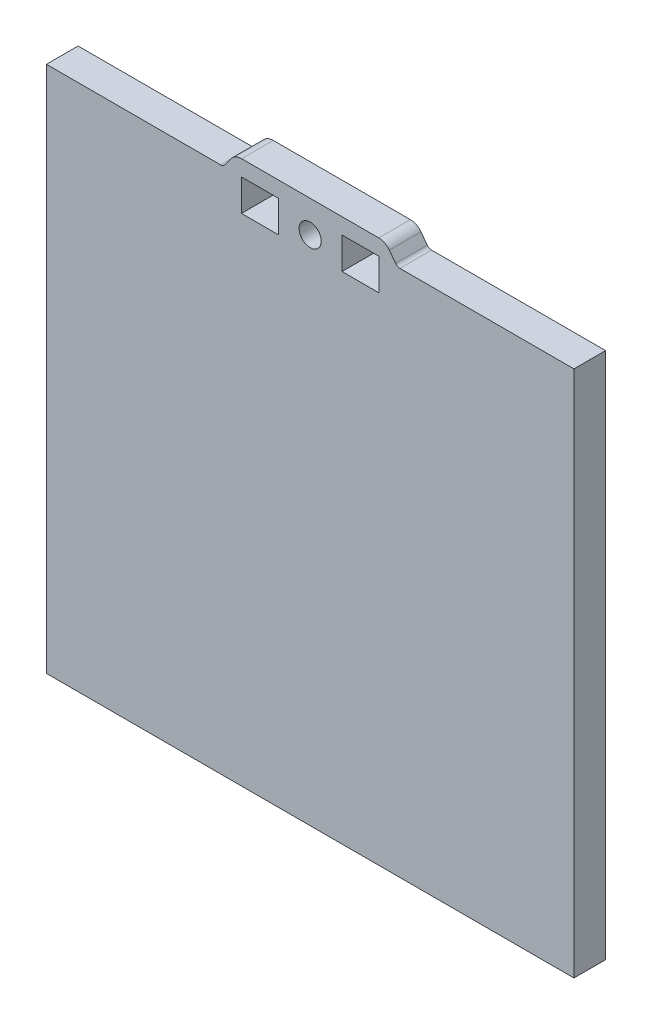
ISO-10303-21;
HEADER;
FILE_DESCRIPTION(('STEP AP214'),'2;1');
FILE_NAME('part.step','',(''),(''),'','','');
FILE_SCHEMA(('AUTOMOTIVE_DESIGN { 1 0 10303 214 1 1 1 1 }'));
ENDSEC;
DATA;
#1=APPLICATION_CONTEXT('core data for automotive mechanical design processes');
#2=APPLICATION_PROTOCOL_DEFINITION('international standard','automotive_design',2000,#1);
#3=PRODUCT_CONTEXT('',#1,'mechanical');
#4=PRODUCT('Part','Part','',(#3));
#5=PRODUCT_RELATED_PRODUCT_CATEGORY('part','',(#4));
#6=PRODUCT_DEFINITION_FORMATION('','',#4);
#7=PRODUCT_DEFINITION_CONTEXT('part definition',#1,'design');
#8=PRODUCT_DEFINITION('design','',#6,#7);
#9=PRODUCT_DEFINITION_SHAPE('','',#8);
#10=(LENGTH_UNIT() NAMED_UNIT(*) SI_UNIT(.MILLI.,.METRE.));
#11=(NAMED_UNIT(*) PLANE_ANGLE_UNIT() SI_UNIT($,.RADIAN.));
#12=(NAMED_UNIT(*) SI_UNIT($,.STERADIAN.) SOLID_ANGLE_UNIT());
#13=UNCERTAINTY_MEASURE_WITH_UNIT(LENGTH_MEASURE(1.E-05),#10,'distance_accuracy_value','');
#14=(GEOMETRIC_REPRESENTATION_CONTEXT(3) GLOBAL_UNCERTAINTY_ASSIGNED_CONTEXT((#13)) GLOBAL_UNIT_ASSIGNED_CONTEXT((#10,
#11,#12)) REPRESENTATION_CONTEXT('',''));
#15=CARTESIAN_POINT('',(0.,0.,0.));
#16=DIRECTION('',(0.,0.,1.));
#17=DIRECTION('',(1.,0.,0.));
#18=AXIS2_PLACEMENT_3D('',#15,#16,#17);
#19=CARTESIAN_POINT('',(-50.,50.,6.));
#20=DIRECTION('',(0.,-1.,0.));
#21=DIRECTION('',(0.,0.,-1.));
#22=AXIS2_PLACEMENT_3D('',#19,#20,#21);
#23=PLANE('',#22);
#24=DIRECTION('',(-1.,0.,0.));
#25=VECTOR('',#24,1.);
#26=CARTESIAN_POINT('',(-50.,50.,6.));
#27=LINE('',#26,#25);
#28=CARTESIAN_POINT('',(-17.,50.,6.));
#29=VERTEX_POINT('',#28);
#30=CARTESIAN_POINT('',(-50.,50.,6.));
#31=VERTEX_POINT('',#30);
#32=EDGE_CURVE('E313',#29,#31,#27,.T.);
#33=ORIENTED_EDGE('',*,*,#32,.F.);
#34=DIRECTION('',(0.,0.,-1.));
#35=VECTOR('',#34,1.);
#36=CARTESIAN_POINT('',(-17.,50.,6.));
#37=LINE('',#36,#35);
#38=CARTESIAN_POINT('',(-17.,50.,0.));
#39=VERTEX_POINT('',#38);
#40=EDGE_CURVE('E303',#29,#39,#37,.T.);
#41=ORIENTED_EDGE('',*,*,#40,.T.);
#42=DIRECTION('',(-1.,0.,0.));
#43=VECTOR('',#42,1.);
#44=CARTESIAN_POINT('',(-50.,50.,0.));
#45=LINE('',#44,#43);
#46=CARTESIAN_POINT('',(-50.,50.,0.));
#47=VERTEX_POINT('',#46);
#48=EDGE_CURVE('E325',#39,#47,#45,.T.);
#49=ORIENTED_EDGE('',*,*,#48,.T.);
#50=DIRECTION('',(0.,0.,-1.));
#51=VECTOR('',#50,1.);
#52=CARTESIAN_POINT('',(-50.,50.,6.));
#53=LINE('',#52,#51);
#54=EDGE_CURVE('E45',#31,#47,#53,.T.);
#55=ORIENTED_EDGE('',*,*,#54,.F.);
#56=EDGE_LOOP('',(#33,#41,#49,#55));
#57=FACE_BOUND('',#56,.T.);
#58=ADVANCED_FACE('F37',(#57),#23,.F.);
#59=CARTESIAN_POINT('',(50.,-50.,6.));
#60=DIRECTION('',(-1.,0.,0.));
#61=DIRECTION('',(0.,0.,1.));
#62=AXIS2_PLACEMENT_3D('',#59,#60,#61);
#63=PLANE('',#62);
#64=DIRECTION('',(0.,1.,0.));
#65=VECTOR('',#64,1.);
#66=CARTESIAN_POINT('',(50.,-50.,0.));
#67=LINE('',#66,#65);
#68=CARTESIAN_POINT('',(50.,-50.,0.));
#69=VERTEX_POINT('',#68);
#70=CARTESIAN_POINT('',(50.,50.,0.));
#71=VERTEX_POINT('',#70);
#72=EDGE_CURVE('E309',#69,#71,#67,.T.);
#73=ORIENTED_EDGE('',*,*,#72,.T.);
#74=DIRECTION('',(0.,0.,-1.));
#75=VECTOR('',#74,1.);
#76=CARTESIAN_POINT('',(50.,50.,6.));
#77=LINE('',#76,#75);
#78=CARTESIAN_POINT('',(50.,50.,6.));
#79=VERTEX_POINT('',#78);
#80=EDGE_CURVE('E11',#79,#71,#77,.T.);
#81=ORIENTED_EDGE('',*,*,#80,.F.);
#82=DIRECTION('',(0.,1.,0.));
#83=VECTOR('',#82,1.);
#84=CARTESIAN_POINT('',(50.,-50.,6.));
#85=LINE('',#84,#83);
#86=CARTESIAN_POINT('',(50.,-50.,6.));
#87=VERTEX_POINT('',#86);
#88=EDGE_CURVE('E310',#87,#79,#85,.T.);
#89=ORIENTED_EDGE('',*,*,#88,.F.);
#90=DIRECTION('',(0.,0.,-1.));
#91=VECTOR('',#90,1.);
#92=CARTESIAN_POINT('',(50.,-50.,6.));
#93=LINE('',#92,#91);
#94=EDGE_CURVE('E322',#87,#69,#93,.T.);
#95=ORIENTED_EDGE('',*,*,#94,.T.);
#96=EDGE_LOOP('',(#73,#81,#89,#95));
#97=FACE_BOUND('',#96,.T.);
#98=ADVANCED_FACE('F39',(#97),#63,.F.);
#99=CARTESIAN_POINT('',(17.,50.,0.));
#100=VERTEX_POINT('',#99);
#101=EDGE_CURVE('E326',#71,#100,#45,.T.);
#102=ORIENTED_EDGE('',*,*,#101,.T.);
#103=DIRECTION('',(0.,0.,-1.));
#104=VECTOR('',#103,1.);
#105=CARTESIAN_POINT('',(17.,50.,6.));
#106=LINE('',#105,#104);
#107=CARTESIAN_POINT('',(17.,50.,6.));
#108=VERTEX_POINT('',#107);
#109=EDGE_CURVE('E300',#108,#100,#106,.T.);
#110=ORIENTED_EDGE('',*,*,#109,.F.);
#111=EDGE_CURVE('E315',#79,#108,#27,.T.);
#112=ORIENTED_EDGE('',*,*,#111,.F.);
#113=ORIENTED_EDGE('',*,*,#80,.T.);
#114=EDGE_LOOP('',(#102,#110,#112,#113));
#115=FACE_BOUND('',#114,.T.);
#116=ADVANCED_FACE('F385',(#115),#23,.F.);
#117=CARTESIAN_POINT('',(-50.,-50.,6.));
#118=DIRECTION('',(1.,0.,0.));
#119=DIRECTION('',(0.,0.,-1.));
#120=AXIS2_PLACEMENT_3D('',#117,#118,#119);
#121=PLANE('',#120);
#122=DIRECTION('',(0.,-1.,0.));
#123=VECTOR('',#122,1.);
#124=CARTESIAN_POINT('',(-50.,-50.,0.));
#125=LINE('',#124,#123);
#126=CARTESIAN_POINT('',(-50.,-50.,0.));
#127=VERTEX_POINT('',#126);
#128=EDGE_CURVE('E328',#47,#127,#125,.T.);
#129=ORIENTED_EDGE('',*,*,#128,.T.);
#130=DIRECTION('',(0.,0.,-1.));
#131=VECTOR('',#130,1.);
#132=CARTESIAN_POINT('',(-50.,-50.,6.));
#133=LINE('',#132,#131);
#134=CARTESIAN_POINT('',(-50.,-50.,6.));
#135=VERTEX_POINT('',#134);
#136=EDGE_CURVE('E333',#135,#127,#133,.T.);
#137=ORIENTED_EDGE('',*,*,#136,.F.);
#138=DIRECTION('',(0.,-1.,0.));
#139=VECTOR('',#138,1.);
#140=CARTESIAN_POINT('',(-50.,-50.,6.));
#141=LINE('',#140,#139);
#142=EDGE_CURVE('E318',#31,#135,#141,.T.);
#143=ORIENTED_EDGE('',*,*,#142,.F.);
#144=ORIENTED_EDGE('',*,*,#54,.T.);
#145=EDGE_LOOP('',(#129,#137,#143,#144));
#146=FACE_BOUND('',#145,.T.);
#147=ADVANCED_FACE('F340',(#146),#121,.F.);
#148=CARTESIAN_POINT('',(-50.,-50.,6.));
#149=DIRECTION('',(0.,1.,0.));
#150=DIRECTION('',(0.,0.,1.));
#151=AXIS2_PLACEMENT_3D('',#148,#149,#150);
#152=PLANE('',#151);
#153=DIRECTION('',(1.,0.,0.));
#154=VECTOR('',#153,1.);
#155=CARTESIAN_POINT('',(-50.,-50.,0.));
#156=LINE('',#155,#154);
#157=EDGE_CURVE('E314',#127,#69,#156,.T.);
#158=ORIENTED_EDGE('',*,*,#157,.T.);
#159=ORIENTED_EDGE('',*,*,#94,.F.);
#160=DIRECTION('',(1.,0.,0.));
#161=VECTOR('',#160,1.);
#162=CARTESIAN_POINT('',(-50.,-50.,6.));
#163=LINE('',#162,#161);
#164=EDGE_CURVE('E320',#135,#87,#163,.T.);
#165=ORIENTED_EDGE('',*,*,#164,.F.);
#166=ORIENTED_EDGE('',*,*,#136,.T.);
#167=EDGE_LOOP('',(#158,#159,#165,#166));
#168=FACE_BOUND('',#167,.T.);
#169=ADVANCED_FACE('F348',(#168),#152,.F.);
#170=CARTESIAN_POINT('',(0.,0.,6.));
#171=DIRECTION('',(0.,0.,-1.));
#172=DIRECTION('',(-1.,0.,0.));
#173=AXIS2_PLACEMENT_3D('',#170,#171,#172);
#174=PLANE('',#173);
#175=DIRECTION('',(-1.,0.,0.));
#176=VECTOR('',#175,1.);
#177=CARTESIAN_POINT('',(13.0318499082157,50.,6.));
#178=LINE('',#177,#176);
#179=CARTESIAN_POINT('',(13.0318499082157,50.,6.));
#180=VERTEX_POINT('',#179);
#181=CARTESIAN_POINT('',(6.03184990821572,50.,6.));
#182=VERTEX_POINT('',#181);
#183=EDGE_CURVE('E204',#180,#182,#178,.T.);
#184=ORIENTED_EDGE('',*,*,#183,.F.);
#185=DIRECTION('',(0.,1.,0.));
#186=VECTOR('',#185,1.);
#187=CARTESIAN_POINT('',(13.0318499082157,50.,6.));
#188=LINE('',#187,#186);
#189=CARTESIAN_POINT('',(13.0318499082157,44.,6.));
#190=VERTEX_POINT('',#189);
#191=EDGE_CURVE('E52',#190,#180,#188,.T.);
#192=ORIENTED_EDGE('',*,*,#191,.F.);
#193=DIRECTION('',(1.,0.,0.));
#194=VECTOR('',#193,1.);
#195=CARTESIAN_POINT('',(13.0318499082157,44.,6.));
#196=LINE('',#195,#194);
#197=CARTESIAN_POINT('',(6.03184990821572,44.,6.));
#198=VERTEX_POINT('',#197);
#199=EDGE_CURVE('E195',#198,#190,#196,.T.);
#200=ORIENTED_EDGE('',*,*,#199,.F.);
#201=DIRECTION('',(0.,-1.,0.));
#202=VECTOR('',#201,1.);
#203=CARTESIAN_POINT('',(6.03184990821572,50.,6.));
#204=LINE('',#203,#202);
#205=EDGE_CURVE('E198',#182,#198,#204,.T.);
#206=ORIENTED_EDGE('',*,*,#205,.F.);
#207=EDGE_LOOP('',(#184,#192,#200,#206));
#208=FACE_BOUND('',#207,.T.);
#209=DIRECTION('',(1.,0.,0.));
#210=VECTOR('',#209,1.);
#211=CARTESIAN_POINT('',(-13.0318499082157,44.,6.));
#212=LINE('',#211,#210);
#213=CARTESIAN_POINT('',(-13.0318499082157,44.,6.));
#214=VERTEX_POINT('',#213);
#215=CARTESIAN_POINT('',(-6.03184990821574,44.,6.));
#216=VERTEX_POINT('',#215);
#217=EDGE_CURVE('E230',#214,#216,#212,.T.);
#218=ORIENTED_EDGE('',*,*,#217,.F.);
#219=DIRECTION('',(0.,-1.,0.));
#220=VECTOR('',#219,1.);
#221=CARTESIAN_POINT('',(-13.0318499082157,50.,6.));
#222=LINE('',#221,#220);
#223=CARTESIAN_POINT('',(-13.0318499082157,50.,6.));
#224=VERTEX_POINT('',#223);
#225=EDGE_CURVE('E60',#224,#214,#222,.T.);
#226=ORIENTED_EDGE('',*,*,#225,.F.);
#227=DIRECTION('',(-1.,0.,0.));
#228=VECTOR('',#227,1.);
#229=CARTESIAN_POINT('',(-13.0318499082157,50.,6.));
#230=LINE('',#229,#228);
#231=CARTESIAN_POINT('',(-6.03184990821574,50.,6.));
#232=VERTEX_POINT('',#231);
#233=EDGE_CURVE('E219',#232,#224,#230,.T.);
#234=ORIENTED_EDGE('',*,*,#233,.F.);
#235=DIRECTION('',(0.,1.,0.));
#236=VECTOR('',#235,1.);
#237=CARTESIAN_POINT('',(-6.03184990821574,50.,6.));
#238=LINE('',#237,#236);
#239=EDGE_CURVE('E234',#216,#232,#238,.T.);
#240=ORIENTED_EDGE('',*,*,#239,.F.);
#241=EDGE_LOOP('',(#218,#226,#234,#240));
#242=FACE_BOUND('',#241,.T.);
#243=CARTESIAN_POINT('',(0.,47.0000000000004,6.));
#244=DIRECTION('',(0.,0.,1.));
#245=DIRECTION('',(1.,0.,0.));
#246=AXIS2_PLACEMENT_3D('',#243,#244,#245);
#247=CIRCLE('',#246,2.1);
#248=CARTESIAN_POINT('',(2.1,47.0000000000004,6.));
#249=VERTEX_POINT('',#248);
#250=EDGE_CURVE('E247',#249,#249,#247,.T.);
#251=ORIENTED_EDGE('',*,*,#250,.F.);
#252=EDGE_LOOP('',(#251));
#253=FACE_BOUND('',#252,.T.);
#254=ORIENTED_EDGE('',*,*,#88,.T.);
#255=ORIENTED_EDGE('',*,*,#111,.T.);
#256=CARTESIAN_POINT('',(17.,51.,6.));
#257=DIRECTION('',(0.,0.,1.));
#258=DIRECTION('',(1.,0.,0.));
#259=AXIS2_PLACEMENT_3D('',#256,#257,#258);
#260=CIRCLE('',#259,0.999999999999997);
#261=CARTESIAN_POINT('',(16.2,50.4,6.));
#262=VERTEX_POINT('',#261);
#263=EDGE_CURVE('E257',#262,#108,#260,.T.);
#264=ORIENTED_EDGE('',*,*,#263,.F.);
#265=DIRECTION('',(0.6,-0.8,0.));
#266=VECTOR('',#265,1.);
#267=CARTESIAN_POINT('',(34.56,25.92,6.));
#268=LINE('',#267,#266);
#269=CARTESIAN_POINT('',(15.,52.,6.));
#270=VERTEX_POINT('',#269);
#271=EDGE_CURVE('E260',#270,#262,#268,.T.);
#272=ORIENTED_EDGE('',*,*,#271,.F.);
#273=CARTESIAN_POINT('',(13.,50.5,6.));
#274=DIRECTION('',(0.,0.,1.));
#275=DIRECTION('',(1.,0.,0.));
#276=AXIS2_PLACEMENT_3D('',#273,#274,#275);
#277=CIRCLE('',#276,2.49999999999999);
#278=CARTESIAN_POINT('',(13.,53.,6.));
#279=VERTEX_POINT('',#278);
#280=EDGE_CURVE('E263',#279,#270,#277,.F.);
#281=ORIENTED_EDGE('',*,*,#280,.F.);
#282=DIRECTION('',(1.,0.,0.));
#283=VECTOR('',#282,1.);
#284=CARTESIAN_POINT('',(0.,53.,6.));
#285=LINE('',#284,#283);
#286=CARTESIAN_POINT('',(-13.,53.,6.));
#287=VERTEX_POINT('',#286);
#288=EDGE_CURVE('E266',#287,#279,#285,.T.);
#289=ORIENTED_EDGE('',*,*,#288,.F.);
#290=CARTESIAN_POINT('',(-13.,50.5,6.));
#291=DIRECTION('',(0.,0.,1.));
#292=DIRECTION('',(1.,0.,0.));
#293=AXIS2_PLACEMENT_3D('',#290,#291,#292);
#294=CIRCLE('',#293,2.49999999999999);
#295=CARTESIAN_POINT('',(-15.,52.,6.));
#296=VERTEX_POINT('',#295);
#297=EDGE_CURVE('E269',#287,#296,#294,.T.);
#298=ORIENTED_EDGE('',*,*,#297,.T.);
#299=DIRECTION('',(-0.6,-0.8,0.));
#300=VECTOR('',#299,1.);
#301=CARTESIAN_POINT('',(-34.56,25.92,6.));
#302=LINE('',#301,#300);
#303=CARTESIAN_POINT('',(-16.2,50.4,6.));
#304=VERTEX_POINT('',#303);
#305=EDGE_CURVE('E250',#296,#304,#302,.T.);
#306=ORIENTED_EDGE('',*,*,#305,.T.);
#307=CARTESIAN_POINT('',(-17.,51.,6.));
#308=DIRECTION('',(0.,0.,1.));
#309=DIRECTION('',(1.,0.,0.));
#310=AXIS2_PLACEMENT_3D('',#307,#308,#309);
#311=CIRCLE('',#310,0.999999999999997);
#312=EDGE_CURVE('E253',#304,#29,#311,.F.);
#313=ORIENTED_EDGE('',*,*,#312,.T.);
#314=ORIENTED_EDGE('',*,*,#32,.T.);
#315=ORIENTED_EDGE('',*,*,#142,.T.);
#316=ORIENTED_EDGE('',*,*,#164,.T.);
#317=EDGE_LOOP('',(#254,#255,#264,#272,#281,#289,#298,#306,#313,#314,#315,#316));
#318=FACE_BOUND('',#317,.T.);
#319=ADVANCED_FACE('F354',(#208,#242,#253,#318),#174,.F.);
#320=CARTESIAN_POINT('',(0.,0.,0.));
#321=DIRECTION('',(0.,0.,-1.));
#322=DIRECTION('',(-1.,0.,0.));
#323=AXIS2_PLACEMENT_3D('',#320,#321,#322);
#324=PLANE('',#323);
#325=DIRECTION('',(0.,1.,0.));
#326=VECTOR('',#325,1.);
#327=CARTESIAN_POINT('',(13.0318499082157,50.,0.));
#328=LINE('',#327,#326);
#329=CARTESIAN_POINT('',(13.0318499082157,44.,0.));
#330=VERTEX_POINT('',#329);
#331=CARTESIAN_POINT('',(13.0318499082157,50.,0.));
#332=VERTEX_POINT('',#331);
#333=EDGE_CURVE('E176',#330,#332,#328,.T.);
#334=ORIENTED_EDGE('',*,*,#333,.T.);
#335=DIRECTION('',(-1.,0.,0.));
#336=VECTOR('',#335,1.);
#337=CARTESIAN_POINT('',(13.0318499082157,50.,0.));
#338=LINE('',#337,#336);
#339=CARTESIAN_POINT('',(6.03184990821572,50.,0.));
#340=VERTEX_POINT('',#339);
#341=EDGE_CURVE('E186',#332,#340,#338,.T.);
#342=ORIENTED_EDGE('',*,*,#341,.T.);
#343=DIRECTION('',(0.,-1.,0.));
#344=VECTOR('',#343,1.);
#345=CARTESIAN_POINT('',(6.03184990821572,50.,0.));
#346=LINE('',#345,#344);
#347=CARTESIAN_POINT('',(6.03184990821572,44.,0.));
#348=VERTEX_POINT('',#347);
#349=EDGE_CURVE('E190',#340,#348,#346,.T.);
#350=ORIENTED_EDGE('',*,*,#349,.T.);
#351=DIRECTION('',(1.,0.,0.));
#352=VECTOR('',#351,1.);
#353=CARTESIAN_POINT('',(13.0318499082157,44.,0.));
#354=LINE('',#353,#352);
#355=EDGE_CURVE('E182',#348,#330,#354,.T.);
#356=ORIENTED_EDGE('',*,*,#355,.T.);
#357=EDGE_LOOP('',(#334,#342,#350,#356));
#358=FACE_BOUND('',#357,.T.);
#359=DIRECTION('',(0.,-1.,0.));
#360=VECTOR('',#359,1.);
#361=CARTESIAN_POINT('',(-13.0318499082157,50.,0.));
#362=LINE('',#361,#360);
#363=CARTESIAN_POINT('',(-13.0318499082157,50.,0.));
#364=VERTEX_POINT('',#363);
#365=CARTESIAN_POINT('',(-13.0318499082157,44.,0.));
#366=VERTEX_POINT('',#365);
#367=EDGE_CURVE('E215',#364,#366,#362,.T.);
#368=ORIENTED_EDGE('',*,*,#367,.T.);
#369=DIRECTION('',(1.,0.,0.));
#370=VECTOR('',#369,1.);
#371=CARTESIAN_POINT('',(-13.0318499082157,44.,0.));
#372=LINE('',#371,#370);
#373=CARTESIAN_POINT('',(-6.03184990821574,44.,0.));
#374=VERTEX_POINT('',#373);
#375=EDGE_CURVE('E218',#366,#374,#372,.T.);
#376=ORIENTED_EDGE('',*,*,#375,.T.);
#377=DIRECTION('',(0.,1.,0.));
#378=VECTOR('',#377,1.);
#379=CARTESIAN_POINT('',(-6.03184990821574,50.,0.));
#380=LINE('',#379,#378);
#381=CARTESIAN_POINT('',(-6.03184990821574,50.,0.));
#382=VERTEX_POINT('',#381);
#383=EDGE_CURVE('E222',#374,#382,#380,.T.);
#384=ORIENTED_EDGE('',*,*,#383,.T.);
#385=DIRECTION('',(-1.,0.,0.));
#386=VECTOR('',#385,1.);
#387=CARTESIAN_POINT('',(-13.0318499082157,50.,0.));
#388=LINE('',#387,#386);
#389=EDGE_CURVE('E225',#382,#364,#388,.T.);
#390=ORIENTED_EDGE('',*,*,#389,.T.);
#391=EDGE_LOOP('',(#368,#376,#384,#390));
#392=FACE_BOUND('',#391,.T.);
#393=CARTESIAN_POINT('',(0.,47.0000000000004,0.));
#394=DIRECTION('',(0.,0.,1.));
#395=DIRECTION('',(1.,0.,0.));
#396=AXIS2_PLACEMENT_3D('',#393,#394,#395);
#397=CIRCLE('',#396,2.1);
#398=CARTESIAN_POINT('',(2.1,47.0000000000004,0.));
#399=VERTEX_POINT('',#398);
#400=EDGE_CURVE('E231',#399,#399,#397,.T.);
#401=ORIENTED_EDGE('',*,*,#400,.T.);
#402=EDGE_LOOP('',(#401));
#403=FACE_BOUND('',#402,.T.);
#404=ORIENTED_EDGE('',*,*,#72,.F.);
#405=ORIENTED_EDGE('',*,*,#157,.F.);
#406=ORIENTED_EDGE('',*,*,#128,.F.);
#407=ORIENTED_EDGE('',*,*,#48,.F.);
#408=CARTESIAN_POINT('',(-17.,51.,0.));
#409=DIRECTION('',(0.,0.,1.));
#410=DIRECTION('',(1.,0.,0.));
#411=AXIS2_PLACEMENT_3D('',#408,#409,#410);
#412=CIRCLE('',#411,0.999999999999997);
#413=CARTESIAN_POINT('',(-16.2,50.4,0.));
#414=VERTEX_POINT('',#413);
#415=EDGE_CURVE('E274',#414,#39,#412,.F.);
#416=ORIENTED_EDGE('',*,*,#415,.F.);
#417=DIRECTION('',(-0.6,-0.8,0.));
#418=VECTOR('',#417,1.);
#419=CARTESIAN_POINT('',(-34.56,25.92,0.));
#420=LINE('',#419,#418);
#421=CARTESIAN_POINT('',(-15.,52.,0.));
#422=VERTEX_POINT('',#421);
#423=EDGE_CURVE('E211',#422,#414,#420,.T.);
#424=ORIENTED_EDGE('',*,*,#423,.F.);
#425=CARTESIAN_POINT('',(-13.,50.5,0.));
#426=DIRECTION('',(0.,0.,1.));
#427=DIRECTION('',(1.,0.,0.));
#428=AXIS2_PLACEMENT_3D('',#425,#426,#427);
#429=CIRCLE('',#428,2.49999999999999);
#430=CARTESIAN_POINT('',(-13.,53.,0.));
#431=VERTEX_POINT('',#430);
#432=EDGE_CURVE('E254',#431,#422,#429,.T.);
#433=ORIENTED_EDGE('',*,*,#432,.F.);
#434=DIRECTION('',(1.,0.,0.));
#435=VECTOR('',#434,1.);
#436=CARTESIAN_POINT('',(0.,53.,0.));
#437=LINE('',#436,#435);
#438=CARTESIAN_POINT('',(13.,53.,0.));
#439=VERTEX_POINT('',#438);
#440=EDGE_CURVE('E286',#431,#439,#437,.T.);
#441=ORIENTED_EDGE('',*,*,#440,.T.);
#442=CARTESIAN_POINT('',(13.,50.5,0.));
#443=DIRECTION('',(0.,0.,1.));
#444=DIRECTION('',(1.,0.,0.));
#445=AXIS2_PLACEMENT_3D('',#442,#443,#444);
#446=CIRCLE('',#445,2.49999999999999);
#447=CARTESIAN_POINT('',(15.,52.,0.));
#448=VERTEX_POINT('',#447);
#449=EDGE_CURVE('E283',#439,#448,#446,.F.);
#450=ORIENTED_EDGE('',*,*,#449,.T.);
#451=DIRECTION('',(0.6,-0.8,0.));
#452=VECTOR('',#451,1.);
#453=CARTESIAN_POINT('',(34.56,25.92,0.));
#454=LINE('',#453,#452);
#455=CARTESIAN_POINT('',(16.2,50.4,0.));
#456=VERTEX_POINT('',#455);
#457=EDGE_CURVE('E280',#448,#456,#454,.T.);
#458=ORIENTED_EDGE('',*,*,#457,.T.);
#459=CARTESIAN_POINT('',(17.,51.,0.));
#460=DIRECTION('',(0.,0.,1.));
#461=DIRECTION('',(1.,0.,0.));
#462=AXIS2_PLACEMENT_3D('',#459,#460,#461);
#463=CIRCLE('',#462,0.999999999999997);
#464=EDGE_CURVE('E277',#456,#100,#463,.T.);
#465=ORIENTED_EDGE('',*,*,#464,.T.);
#466=ORIENTED_EDGE('',*,*,#101,.F.);
#467=EDGE_LOOP('',(#404,#405,#406,#407,#416,#424,#433,#441,#450,#458,#465,#466));
#468=FACE_BOUND('',#467,.T.);
#469=ADVANCED_FACE('F192',(#358,#392,#403,#468),#324,.T.);
#470=CARTESIAN_POINT('',(-34.56,25.92,6.));
#471=DIRECTION('',(0.8,-0.6,0.));
#472=DIRECTION('',(0.6,0.8,0.));
#473=AXIS2_PLACEMENT_3D('',#470,#471,#472);
#474=PLANE('',#473);
#475=ORIENTED_EDGE('',*,*,#423,.T.);
#476=DIRECTION('',(0.,0.,-1.));
#477=VECTOR('',#476,1.);
#478=CARTESIAN_POINT('',(-16.2,50.4,6.));
#479=LINE('',#478,#477);
#480=EDGE_CURVE('E306',#304,#414,#479,.T.);
#481=ORIENTED_EDGE('',*,*,#480,.F.);
#482=ORIENTED_EDGE('',*,*,#305,.F.);
#483=DIRECTION('',(0.,0.,-1.));
#484=VECTOR('',#483,1.);
#485=CARTESIAN_POINT('',(-15.,52.,6.));
#486=LINE('',#485,#484);
#487=EDGE_CURVE('E271',#296,#422,#486,.T.);
#488=ORIENTED_EDGE('',*,*,#487,.T.);
#489=EDGE_LOOP('',(#475,#481,#482,#488));
#490=FACE_BOUND('',#489,.T.);
#491=ADVANCED_FACE('F364',(#490),#474,.F.);
#492=CARTESIAN_POINT('',(-17.,51.,6.));
#493=DIRECTION('',(0.,0.,-1.));
#494=DIRECTION('',(-1.,0.,0.));
#495=AXIS2_PLACEMENT_3D('',#492,#493,#494);
#496=CYLINDRICAL_SURFACE('',#495,0.999999999999997);
#497=ORIENTED_EDGE('',*,*,#415,.T.);
#498=ORIENTED_EDGE('',*,*,#40,.F.);
#499=ORIENTED_EDGE('',*,*,#312,.F.);
#500=ORIENTED_EDGE('',*,*,#480,.T.);
#501=EDGE_LOOP('',(#497,#498,#499,#500));
#502=FACE_BOUND('',#501,.T.);
#503=ADVANCED_FACE('F358',(#502),#496,.F.);
#504=CARTESIAN_POINT('',(17.,51.,6.));
#505=DIRECTION('',(0.,0.,-1.));
#506=DIRECTION('',(-1.,0.,0.));
#507=AXIS2_PLACEMENT_3D('',#504,#505,#506);
#508=CYLINDRICAL_SURFACE('',#507,0.999999999999997);
#509=ORIENTED_EDGE('',*,*,#464,.F.);
#510=DIRECTION('',(0.,0.,-1.));
#511=VECTOR('',#510,1.);
#512=CARTESIAN_POINT('',(16.2,50.4,6.));
#513=LINE('',#512,#511);
#514=EDGE_CURVE('E298',#262,#456,#513,.T.);
#515=ORIENTED_EDGE('',*,*,#514,.F.);
#516=ORIENTED_EDGE('',*,*,#263,.T.);
#517=ORIENTED_EDGE('',*,*,#109,.T.);
#518=EDGE_LOOP('',(#509,#515,#516,#517));
#519=FACE_BOUND('',#518,.T.);
#520=ADVANCED_FACE('F383',(#519),#508,.F.);
#521=CARTESIAN_POINT('',(34.56,25.92,6.));
#522=DIRECTION('',(0.8,0.6,0.));
#523=DIRECTION('',(-0.6,0.8,0.));
#524=AXIS2_PLACEMENT_3D('',#521,#522,#523);
#525=PLANE('',#524);
#526=ORIENTED_EDGE('',*,*,#457,.F.);
#527=DIRECTION('',(0.,0.,-1.));
#528=VECTOR('',#527,1.);
#529=CARTESIAN_POINT('',(15.,52.,6.));
#530=LINE('',#529,#528);
#531=EDGE_CURVE('E296',#270,#448,#530,.T.);
#532=ORIENTED_EDGE('',*,*,#531,.F.);
#533=ORIENTED_EDGE('',*,*,#271,.T.);
#534=ORIENTED_EDGE('',*,*,#514,.T.);
#535=EDGE_LOOP('',(#526,#532,#533,#534));
#536=FACE_BOUND('',#535,.T.);
#537=ADVANCED_FACE('F380',(#536),#525,.T.);
#538=CARTESIAN_POINT('',(13.,50.5,6.));
#539=DIRECTION('',(0.,0.,-1.));
#540=DIRECTION('',(-1.,0.,0.));
#541=AXIS2_PLACEMENT_3D('',#538,#539,#540);
#542=CYLINDRICAL_SURFACE('',#541,2.49999999999999);
#543=ORIENTED_EDGE('',*,*,#449,.F.);
#544=DIRECTION('',(0.,0.,-1.));
#545=VECTOR('',#544,1.);
#546=CARTESIAN_POINT('',(13.,53.,6.));
#547=LINE('',#546,#545);
#548=EDGE_CURVE('E294',#279,#439,#547,.T.);
#549=ORIENTED_EDGE('',*,*,#548,.F.);
#550=ORIENTED_EDGE('',*,*,#280,.T.);
#551=ORIENTED_EDGE('',*,*,#531,.T.);
#552=EDGE_LOOP('',(#543,#549,#550,#551));
#553=FACE_BOUND('',#552,.T.);
#554=ADVANCED_FACE('F376',(#553),#542,.T.);
#555=CARTESIAN_POINT('',(0.,53.,6.));
#556=DIRECTION('',(0.,1.,0.));
#557=DIRECTION('',(0.,0.,1.));
#558=AXIS2_PLACEMENT_3D('',#555,#556,#557);
#559=PLANE('',#558);
#560=ORIENTED_EDGE('',*,*,#440,.F.);
#561=DIRECTION('',(0.,0.,-1.));
#562=VECTOR('',#561,1.);
#563=CARTESIAN_POINT('',(-13.,53.,6.));
#564=LINE('',#563,#562);
#565=EDGE_CURVE('E292',#287,#431,#564,.T.);
#566=ORIENTED_EDGE('',*,*,#565,.F.);
#567=ORIENTED_EDGE('',*,*,#288,.T.);
#568=ORIENTED_EDGE('',*,*,#548,.T.);
#569=EDGE_LOOP('',(#560,#566,#567,#568));
#570=FACE_BOUND('',#569,.T.);
#571=ADVANCED_FACE('F372',(#570),#559,.T.);
#572=CARTESIAN_POINT('',(-13.,50.5,6.));
#573=DIRECTION('',(0.,0.,-1.));
#574=DIRECTION('',(-1.,0.,0.));
#575=AXIS2_PLACEMENT_3D('',#572,#573,#574);
#576=CYLINDRICAL_SURFACE('',#575,2.49999999999999);
#577=ORIENTED_EDGE('',*,*,#432,.T.);
#578=ORIENTED_EDGE('',*,*,#487,.F.);
#579=ORIENTED_EDGE('',*,*,#297,.F.);
#580=ORIENTED_EDGE('',*,*,#565,.T.);
#581=EDGE_LOOP('',(#577,#578,#579,#580));
#582=FACE_BOUND('',#581,.T.);
#583=ADVANCED_FACE('F369',(#582),#576,.T.);
#584=CARTESIAN_POINT('',(0.,47.0000000000004,0.));
#585=DIRECTION('',(0.,0.,1.));
#586=DIRECTION('',(1.,0.,0.));
#587=AXIS2_PLACEMENT_3D('',#584,#585,#586);
#588=CYLINDRICAL_SURFACE('',#587,2.1);
#589=ORIENTED_EDGE('',*,*,#400,.F.);
#590=EDGE_LOOP('',(#589));
#591=FACE_BOUND('',#590,.T.);
#592=ORIENTED_EDGE('',*,*,#250,.T.);
#593=EDGE_LOOP('',(#592));
#594=FACE_BOUND('',#593,.T.);
#595=ADVANCED_FACE('F473',(#591,#594),#588,.F.);
#596=CARTESIAN_POINT('',(-13.0318499082157,50.,0.));
#597=DIRECTION('',(-1.,0.,0.));
#598=DIRECTION('',(0.,-1.,0.));
#599=AXIS2_PLACEMENT_3D('',#596,#597,#598);
#600=PLANE('',#599);
#601=ORIENTED_EDGE('',*,*,#225,.T.);
#602=DIRECTION('',(0.,0.,1.));
#603=VECTOR('',#602,1.);
#604=CARTESIAN_POINT('',(-13.0318499082157,44.,0.));
#605=LINE('',#604,#603);
#606=EDGE_CURVE('E228',#366,#214,#605,.T.);
#607=ORIENTED_EDGE('',*,*,#606,.F.);
#608=ORIENTED_EDGE('',*,*,#367,.F.);
#609=DIRECTION('',(0.,0.,1.));
#610=VECTOR('',#609,1.);
#611=CARTESIAN_POINT('',(-13.0318499082157,50.,0.));
#612=LINE('',#611,#610);
#613=EDGE_CURVE('E205',#364,#224,#612,.T.);
#614=ORIENTED_EDGE('',*,*,#613,.T.);
#615=EDGE_LOOP('',(#601,#607,#608,#614));
#616=FACE_BOUND('',#615,.T.);
#617=ADVANCED_FACE('F479',(#616),#600,.F.);
#618=CARTESIAN_POINT('',(-13.0318499082157,50.,0.));
#619=DIRECTION('',(0.,1.,0.));
#620=DIRECTION('',(-1.,0.,0.));
#621=AXIS2_PLACEMENT_3D('',#618,#619,#620);
#622=PLANE('',#621);
#623=ORIENTED_EDGE('',*,*,#233,.T.);
#624=ORIENTED_EDGE('',*,*,#613,.F.);
#625=ORIENTED_EDGE('',*,*,#389,.F.);
#626=DIRECTION('',(0.,0.,1.));
#627=VECTOR('',#626,1.);
#628=CARTESIAN_POINT('',(-6.03184990821574,50.,0.));
#629=LINE('',#628,#627);
#630=EDGE_CURVE('E240',#382,#232,#629,.T.);
#631=ORIENTED_EDGE('',*,*,#630,.T.);
#632=EDGE_LOOP('',(#623,#624,#625,#631));
#633=FACE_BOUND('',#632,.T.);
#634=ADVANCED_FACE('F487',(#633),#622,.F.);
#635=CARTESIAN_POINT('',(-6.03184990821574,50.,0.));
#636=DIRECTION('',(1.,0.,0.));
#637=DIRECTION('',(0.,0.,-1.));
#638=AXIS2_PLACEMENT_3D('',#635,#636,#637);
#639=PLANE('',#638);
#640=ORIENTED_EDGE('',*,*,#239,.T.);
#641=ORIENTED_EDGE('',*,*,#630,.F.);
#642=ORIENTED_EDGE('',*,*,#383,.F.);
#643=DIRECTION('',(0.,0.,1.));
#644=VECTOR('',#643,1.);
#645=CARTESIAN_POINT('',(-6.03184990821574,44.,0.));
#646=LINE('',#645,#644);
#647=EDGE_CURVE('E242',#374,#216,#646,.T.);
#648=ORIENTED_EDGE('',*,*,#647,.T.);
#649=EDGE_LOOP('',(#640,#641,#642,#648));
#650=FACE_BOUND('',#649,.T.);
#651=ADVANCED_FACE('F494',(#650),#639,.F.);
#652=CARTESIAN_POINT('',(-13.0318499082157,44.,0.));
#653=DIRECTION('',(0.,-1.,0.));
#654=DIRECTION('',(0.,0.,-1.));
#655=AXIS2_PLACEMENT_3D('',#652,#653,#654);
#656=PLANE('',#655);
#657=ORIENTED_EDGE('',*,*,#217,.T.);
#658=ORIENTED_EDGE('',*,*,#647,.F.);
#659=ORIENTED_EDGE('',*,*,#375,.F.);
#660=ORIENTED_EDGE('',*,*,#606,.T.);
#661=EDGE_LOOP('',(#657,#658,#659,#660));
#662=FACE_BOUND('',#661,.T.);
#663=ADVANCED_FACE('F502',(#662),#656,.F.);
#664=CARTESIAN_POINT('',(13.0318499082157,50.,0.));
#665=DIRECTION('',(1.,0.,0.));
#666=DIRECTION('',(0.,1.,0.));
#667=AXIS2_PLACEMENT_3D('',#664,#665,#666);
#668=PLANE('',#667);
#669=ORIENTED_EDGE('',*,*,#191,.T.);
#670=DIRECTION('',(0.,0.,1.));
#671=VECTOR('',#670,1.);
#672=CARTESIAN_POINT('',(13.0318499082157,50.,0.));
#673=LINE('',#672,#671);
#674=EDGE_CURVE('E172',#332,#180,#673,.T.);
#675=ORIENTED_EDGE('',*,*,#674,.F.);
#676=ORIENTED_EDGE('',*,*,#333,.F.);
#677=DIRECTION('',(0.,0.,1.));
#678=VECTOR('',#677,1.);
#679=CARTESIAN_POINT('',(13.0318499082157,44.,0.));
#680=LINE('',#679,#678);
#681=EDGE_CURVE('E209',#330,#190,#680,.T.);
#682=ORIENTED_EDGE('',*,*,#681,.T.);
#683=EDGE_LOOP('',(#669,#675,#676,#682));
#684=FACE_BOUND('',#683,.T.);
#685=ADVANCED_FACE('F174',(#684),#668,.F.);
#686=CARTESIAN_POINT('',(13.0318499082157,44.,0.));
#687=DIRECTION('',(0.,-1.,0.));
#688=DIRECTION('',(0.,0.,-1.));
#689=AXIS2_PLACEMENT_3D('',#686,#687,#688);
#690=PLANE('',#689);
#691=ORIENTED_EDGE('',*,*,#199,.T.);
#692=ORIENTED_EDGE('',*,*,#681,.F.);
#693=ORIENTED_EDGE('',*,*,#355,.F.);
#694=DIRECTION('',(0.,0.,1.));
#695=VECTOR('',#694,1.);
#696=CARTESIAN_POINT('',(6.03184990821572,44.,0.));
#697=LINE('',#696,#695);
#698=EDGE_CURVE('E212',#348,#198,#697,.T.);
#699=ORIENTED_EDGE('',*,*,#698,.T.);
#700=EDGE_LOOP('',(#691,#692,#693,#699));
#701=FACE_BOUND('',#700,.T.);
#702=ADVANCED_FACE('F517',(#701),#690,.F.);
#703=CARTESIAN_POINT('',(6.03184990821572,50.,0.));
#704=DIRECTION('',(-1.,0.,0.));
#705=DIRECTION('',(0.,0.,1.));
#706=AXIS2_PLACEMENT_3D('',#703,#704,#705);
#707=PLANE('',#706);
#708=ORIENTED_EDGE('',*,*,#205,.T.);
#709=ORIENTED_EDGE('',*,*,#698,.F.);
#710=ORIENTED_EDGE('',*,*,#349,.F.);
#711=DIRECTION('',(0.,0.,1.));
#712=VECTOR('',#711,1.);
#713=CARTESIAN_POINT('',(6.03184990821572,50.,0.));
#714=LINE('',#713,#712);
#715=EDGE_CURVE('E181',#340,#182,#714,.T.);
#716=ORIENTED_EDGE('',*,*,#715,.T.);
#717=EDGE_LOOP('',(#708,#709,#710,#716));
#718=FACE_BOUND('',#717,.T.);
#719=ADVANCED_FACE('F524',(#718),#707,.F.);
#720=CARTESIAN_POINT('',(13.0318499082157,50.,0.));
#721=DIRECTION('',(0.,1.,0.));
#722=DIRECTION('',(-1.,0.,0.));
#723=AXIS2_PLACEMENT_3D('',#720,#721,#722);
#724=PLANE('',#723);
#725=ORIENTED_EDGE('',*,*,#183,.T.);
#726=ORIENTED_EDGE('',*,*,#715,.F.);
#727=ORIENTED_EDGE('',*,*,#341,.F.);
#728=ORIENTED_EDGE('',*,*,#674,.T.);
#729=EDGE_LOOP('',(#725,#726,#727,#728));
#730=FACE_BOUND('',#729,.T.);
#731=ADVANCED_FACE('F187',(#730),#724,.F.);
#732=CLOSED_SHELL('',(#58,#98,#116,#147,#169,#319,#469,#491,#503,#520,#537,#554,#571,#583,#595,
#617,#634,#651,#663,#685,#702,#719,#731));
#733=MANIFOLD_SOLID_BREP('B2',#732);
#734=ADVANCED_BREP_SHAPE_REPRESENTATION('',(#18,#733),#14);
#735=SHAPE_DEFINITION_REPRESENTATION(#9,#734);
ENDSEC;
END-ISO-10303-21;
